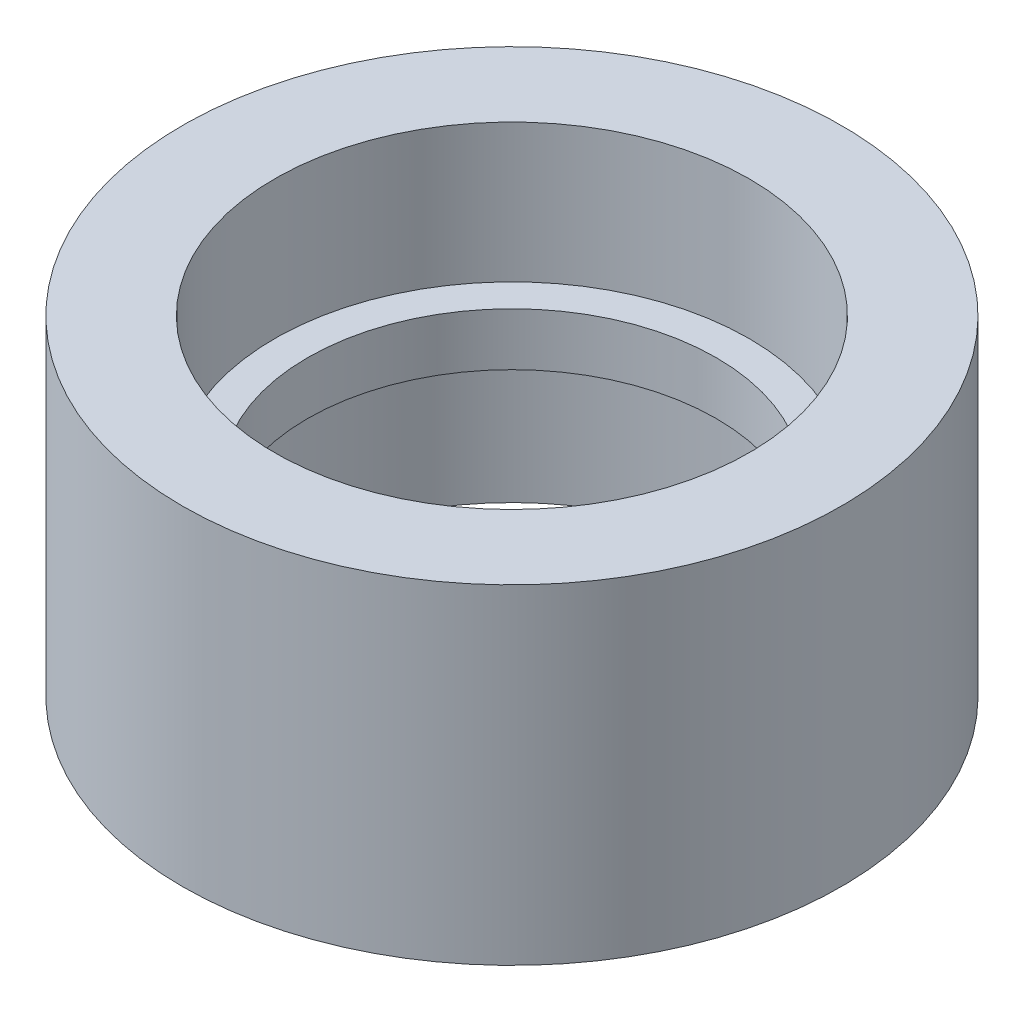
ISO-10303-21;
HEADER;
FILE_DESCRIPTION(('STEP AP214'),'2;1');
FILE_NAME('part.step','',(''),(''),'','','');
FILE_SCHEMA(('AUTOMOTIVE_DESIGN { 1 0 10303 214 1 1 1 1 }'));
ENDSEC;
DATA;
#1=APPLICATION_CONTEXT('core data for automotive mechanical design processes');
#2=APPLICATION_PROTOCOL_DEFINITION('international standard','automotive_design',2000,#1);
#3=PRODUCT_CONTEXT('',#1,'mechanical');
#4=PRODUCT('Part','Part','',(#3));
#5=PRODUCT_RELATED_PRODUCT_CATEGORY('part','',(#4));
#6=PRODUCT_DEFINITION_FORMATION('','',#4);
#7=PRODUCT_DEFINITION_CONTEXT('part definition',#1,'design');
#8=PRODUCT_DEFINITION('design','',#6,#7);
#9=PRODUCT_DEFINITION_SHAPE('','',#8);
#10=(LENGTH_UNIT() NAMED_UNIT(*) SI_UNIT(.MILLI.,.METRE.));
#11=(NAMED_UNIT(*) PLANE_ANGLE_UNIT() SI_UNIT($,.RADIAN.));
#12=(NAMED_UNIT(*) SI_UNIT($,.STERADIAN.) SOLID_ANGLE_UNIT());
#13=UNCERTAINTY_MEASURE_WITH_UNIT(LENGTH_MEASURE(1.E-05),#10,'distance_accuracy_value','');
#14=(GEOMETRIC_REPRESENTATION_CONTEXT(3) GLOBAL_UNCERTAINTY_ASSIGNED_CONTEXT((#13)) GLOBAL_UNIT_ASSIGNED_CONTEXT((#10,
#11,#12)) REPRESENTATION_CONTEXT('',''));
#15=CARTESIAN_POINT('',(0.,0.,0.));
#16=DIRECTION('',(0.,0.,1.));
#17=DIRECTION('',(1.,0.,0.));
#18=AXIS2_PLACEMENT_3D('',#15,#16,#17);
#19=CARTESIAN_POINT('',(0.,0.,0.));
#20=DIRECTION('',(0.,1.,0.));
#21=DIRECTION('',(0.,0.,1.));
#22=AXIS2_PLACEMENT_3D('',#19,#20,#21);
#23=CYLINDRICAL_SURFACE('',#22,31.);
#24=CARTESIAN_POINT('',(0.,29.,0.));
#25=DIRECTION('',(0.,1.,0.));
#26=DIRECTION('',(0.,0.,1.));
#27=AXIS2_PLACEMENT_3D('',#24,#25,#26);
#28=CIRCLE('',#27,31.);
#29=CARTESIAN_POINT('',(0.,29.,31.));
#30=VERTEX_POINT('',#29);
#31=EDGE_CURVE('E17',#30,#30,#28,.T.);
#32=ORIENTED_EDGE('',*,*,#31,.T.);
#33=EDGE_LOOP('',(#32));
#34=FACE_BOUND('',#33,.T.);
#35=CARTESIAN_POINT('',(0.,21.,0.));
#36=DIRECTION('',(0.,1.,0.));
#37=DIRECTION('',(0.,0.,1.));
#38=AXIS2_PLACEMENT_3D('',#35,#36,#37);
#39=CIRCLE('',#38,31.);
#40=CARTESIAN_POINT('',(0.,21.,31.));
#41=VERTEX_POINT('',#40);
#42=EDGE_CURVE('E39',#41,#41,#39,.F.);
#43=ORIENTED_EDGE('',*,*,#42,.T.);
#44=EDGE_LOOP('',(#43));
#45=FACE_BOUND('',#44,.T.);
#46=ADVANCED_FACE('F14',(#34,#45),#23,.F.);
#47=CARTESIAN_POINT('',(0.,29.,0.));
#48=DIRECTION('',(0.,-1.,0.));
#49=DIRECTION('',(0.,0.,-1.));
#50=AXIS2_PLACEMENT_3D('',#47,#48,#49);
#51=PLANE('',#50);
#52=ORIENTED_EDGE('',*,*,#31,.F.);
#53=EDGE_LOOP('',(#52));
#54=FACE_BOUND('',#53,.T.);
#55=CARTESIAN_POINT('',(0.,29.,0.));
#56=DIRECTION('',(0.,-1.,0.));
#57=DIRECTION('',(0.,0.,-1.));
#58=AXIS2_PLACEMENT_3D('',#55,#56,#57);
#59=CIRCLE('',#58,36.);
#60=CARTESIAN_POINT('',(0.,29.,-36.));
#61=VERTEX_POINT('',#60);
#62=EDGE_CURVE('E37',#61,#61,#59,.F.);
#63=ORIENTED_EDGE('',*,*,#62,.T.);
#64=EDGE_LOOP('',(#63));
#65=FACE_BOUND('',#64,.T.);
#66=ADVANCED_FACE('F47',(#54,#65),#51,.F.);
#67=CARTESIAN_POINT('',(0.,21.,0.));
#68=DIRECTION('',(0.,1.,0.));
#69=DIRECTION('',(0.,0.,1.));
#70=AXIS2_PLACEMENT_3D('',#67,#68,#69);
#71=PLANE('',#70);
#72=ORIENTED_EDGE('',*,*,#42,.F.);
#73=EDGE_LOOP('',(#72));
#74=FACE_BOUND('',#73,.T.);
#75=CARTESIAN_POINT('',(0.,21.,0.));
#76=DIRECTION('',(0.,1.,0.));
#77=DIRECTION('',(0.,0.,1.));
#78=AXIS2_PLACEMENT_3D('',#75,#76,#77);
#79=CIRCLE('',#78,36.);
#80=CARTESIAN_POINT('',(0.,21.,36.));
#81=VERTEX_POINT('',#80);
#82=EDGE_CURVE('E34',#81,#81,#79,.F.);
#83=ORIENTED_EDGE('',*,*,#82,.T.);
#84=EDGE_LOOP('',(#83));
#85=FACE_BOUND('',#84,.T.);
#86=ADVANCED_FACE('F50',(#74,#85),#71,.F.);
#87=CARTESIAN_POINT('',(0.,79.,-4.30211422042248E-13));
#88=DIRECTION('',(0.,-1.,0.));
#89=DIRECTION('',(0.,0.,-1.));
#90=AXIS2_PLACEMENT_3D('',#87,#88,#89);
#91=CYLINDRICAL_SURFACE('',#90,36.);
#92=ORIENTED_EDGE('',*,*,#62,.F.);
#93=EDGE_LOOP('',(#92));
#94=FACE_BOUND('',#93,.T.);
#95=CARTESIAN_POINT('',(0.,50.,0.));
#96=DIRECTION('',(0.,-1.,0.));
#97=DIRECTION('',(0.,0.,-1.));
#98=AXIS2_PLACEMENT_3D('',#95,#96,#97);
#99=CIRCLE('',#98,36.);
#100=CARTESIAN_POINT('',(0.,50.,-36.));
#101=VERTEX_POINT('',#100);
#102=EDGE_CURVE('E31',#101,#101,#99,.T.);
#103=ORIENTED_EDGE('',*,*,#102,.F.);
#104=EDGE_LOOP('',(#103));
#105=FACE_BOUND('',#104,.T.);
#106=ADVANCED_FACE('F53',(#94,#105),#91,.F.);
#107=CARTESIAN_POINT('',(0.,-29.,-4.16333634234434E-13));
#108=DIRECTION('',(0.,1.,0.));
#109=DIRECTION('',(0.,0.,1.));
#110=AXIS2_PLACEMENT_3D('',#107,#108,#109);
#111=CYLINDRICAL_SURFACE('',#110,36.);
#112=ORIENTED_EDGE('',*,*,#82,.F.);
#113=EDGE_LOOP('',(#112));
#114=FACE_BOUND('',#113,.T.);
#115=CARTESIAN_POINT('',(0.,0.,0.));
#116=DIRECTION('',(0.,1.,0.));
#117=DIRECTION('',(0.,0.,1.));
#118=AXIS2_PLACEMENT_3D('',#115,#116,#117);
#119=CIRCLE('',#118,36.);
#120=CARTESIAN_POINT('',(0.,0.,36.));
#121=VERTEX_POINT('',#120);
#122=EDGE_CURVE('E26',#121,#121,#119,.F.);
#123=ORIENTED_EDGE('',*,*,#122,.T.);
#124=EDGE_LOOP('',(#123));
#125=FACE_BOUND('',#124,.T.);
#126=ADVANCED_FACE('F56',(#114,#125),#111,.F.);
#127=CARTESIAN_POINT('',(0.,50.,0.));
#128=DIRECTION('',(0.,1.,0.));
#129=DIRECTION('',(0.,0.,1.));
#130=AXIS2_PLACEMENT_3D('',#127,#128,#129);
#131=PLANE('',#130);
#132=ORIENTED_EDGE('',*,*,#102,.T.);
#133=EDGE_LOOP('',(#132));
#134=FACE_BOUND('',#133,.T.);
#135=CARTESIAN_POINT('',(0.,50.,0.));
#136=DIRECTION('',(0.,1.,0.));
#137=DIRECTION('',(0.,0.,1.));
#138=AXIS2_PLACEMENT_3D('',#135,#136,#137);
#139=CIRCLE('',#138,50.);
#140=CARTESIAN_POINT('',(0.,50.,50.));
#141=VERTEX_POINT('',#140);
#142=EDGE_CURVE('E21',#141,#141,#139,.F.);
#143=ORIENTED_EDGE('',*,*,#142,.F.);
#144=EDGE_LOOP('',(#143));
#145=FACE_BOUND('',#144,.T.);
#146=ADVANCED_FACE('F60',(#134,#145),#131,.T.);
#147=CARTESIAN_POINT('',(0.,0.,0.));
#148=DIRECTION('',(0.,1.,0.));
#149=DIRECTION('',(0.,0.,1.));
#150=AXIS2_PLACEMENT_3D('',#147,#148,#149);
#151=PLANE('',#150);
#152=ORIENTED_EDGE('',*,*,#122,.F.);
#153=EDGE_LOOP('',(#152));
#154=FACE_BOUND('',#153,.T.);
#155=CARTESIAN_POINT('',(0.,0.,0.));
#156=DIRECTION('',(0.,1.,0.));
#157=DIRECTION('',(0.,0.,1.));
#158=AXIS2_PLACEMENT_3D('',#155,#156,#157);
#159=CIRCLE('',#158,50.);
#160=CARTESIAN_POINT('',(0.,0.,50.));
#161=VERTEX_POINT('',#160);
#162=EDGE_CURVE('E10',#161,#161,#159,.T.);
#163=ORIENTED_EDGE('',*,*,#162,.F.);
#164=EDGE_LOOP('',(#163));
#165=FACE_BOUND('',#164,.T.);
#166=ADVANCED_FACE('F63',(#154,#165),#151,.F.);
#167=CARTESIAN_POINT('',(0.,0.,0.));
#168=DIRECTION('',(0.,1.,0.));
#169=DIRECTION('',(0.,0.,1.));
#170=AXIS2_PLACEMENT_3D('',#167,#168,#169);
#171=CYLINDRICAL_SURFACE('',#170,50.);
#172=ORIENTED_EDGE('',*,*,#142,.T.);
#173=EDGE_LOOP('',(#172));
#174=FACE_BOUND('',#173,.T.);
#175=ORIENTED_EDGE('',*,*,#162,.T.);
#176=EDGE_LOOP('',(#175));
#177=FACE_BOUND('',#176,.T.);
#178=ADVANCED_FACE('F67',(#174,#177),#171,.T.);
#179=CLOSED_SHELL('',(#46,#66,#86,#106,#126,#146,#166,#178));
#180=MANIFOLD_SOLID_BREP('B1',#179);
#181=ADVANCED_BREP_SHAPE_REPRESENTATION('',(#18,#180),#14);
#182=SHAPE_DEFINITION_REPRESENTATION(#9,#181);
ENDSEC;
END-ISO-10303-21;
